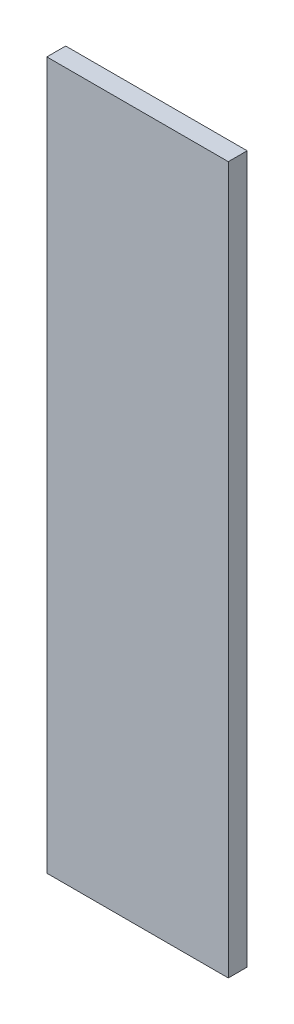
ISO-10303-21;
HEADER;
FILE_DESCRIPTION(('STEP AP214'),'2;1');
FILE_NAME('part.step','',(''),(''),'','','');
FILE_SCHEMA(('AUTOMOTIVE_DESIGN { 1 0 10303 214 1 1 1 1 }'));
ENDSEC;
DATA;
#1=APPLICATION_CONTEXT('core data for automotive mechanical design processes');
#2=APPLICATION_PROTOCOL_DEFINITION('international standard','automotive_design',2000,#1);
#3=PRODUCT_CONTEXT('',#1,'mechanical');
#4=PRODUCT('Part','Part','',(#3));
#5=PRODUCT_RELATED_PRODUCT_CATEGORY('part','',(#4));
#6=PRODUCT_DEFINITION_FORMATION('','',#4);
#7=PRODUCT_DEFINITION_CONTEXT('part definition',#1,'design');
#8=PRODUCT_DEFINITION('design','',#6,#7);
#9=PRODUCT_DEFINITION_SHAPE('','',#8);
#10=(LENGTH_UNIT() NAMED_UNIT(*) SI_UNIT(.MILLI.,.METRE.));
#11=(NAMED_UNIT(*) PLANE_ANGLE_UNIT() SI_UNIT($,.RADIAN.));
#12=(NAMED_UNIT(*) SI_UNIT($,.STERADIAN.) SOLID_ANGLE_UNIT());
#13=UNCERTAINTY_MEASURE_WITH_UNIT(LENGTH_MEASURE(1.E-05),#10,'distance_accuracy_value','');
#14=(GEOMETRIC_REPRESENTATION_CONTEXT(3) GLOBAL_UNCERTAINTY_ASSIGNED_CONTEXT((#13)) GLOBAL_UNIT_ASSIGNED_CONTEXT((#10,
#11,#12)) REPRESENTATION_CONTEXT('',''));
#15=CARTESIAN_POINT('',(0.,0.,0.));
#16=DIRECTION('',(0.,0.,1.));
#17=DIRECTION('',(1.,0.,0.));
#18=AXIS2_PLACEMENT_3D('',#15,#16,#17);
#19=CARTESIAN_POINT('',(-3.85,-15.,0.8));
#20=DIRECTION('',(1.,0.,0.));
#21=DIRECTION('',(0.,0.,-1.));
#22=AXIS2_PLACEMENT_3D('',#19,#20,#21);
#23=PLANE('',#22);
#24=DIRECTION('',(0.,-1.,0.));
#25=VECTOR('',#24,1.);
#26=CARTESIAN_POINT('',(-3.85,-15.,0.));
#27=LINE('',#26,#25);
#28=CARTESIAN_POINT('',(-3.85,15.,0.));
#29=VERTEX_POINT('',#28);
#30=CARTESIAN_POINT('',(-3.85,-15.,0.));
#31=VERTEX_POINT('',#30);
#32=EDGE_CURVE('E102',#29,#31,#27,.T.);
#33=ORIENTED_EDGE('',*,*,#32,.T.);
#34=DIRECTION('',(0.,0.,-1.));
#35=VECTOR('',#34,1.);
#36=CARTESIAN_POINT('',(-3.85,-15.,0.8));
#37=LINE('',#36,#35);
#38=CARTESIAN_POINT('',(-3.85,-15.,0.8));
#39=VERTEX_POINT('',#38);
#40=EDGE_CURVE('E11',#39,#31,#37,.T.);
#41=ORIENTED_EDGE('',*,*,#40,.F.);
#42=DIRECTION('',(0.,-1.,0.));
#43=VECTOR('',#42,1.);
#44=CARTESIAN_POINT('',(-3.85,-15.,0.8));
#45=LINE('',#44,#43);
#46=CARTESIAN_POINT('',(-3.85,15.,0.8));
#47=VERTEX_POINT('',#46);
#48=EDGE_CURVE('E90',#47,#39,#45,.T.);
#49=ORIENTED_EDGE('',*,*,#48,.F.);
#50=DIRECTION('',(0.,0.,-1.));
#51=VECTOR('',#50,1.);
#52=CARTESIAN_POINT('',(-3.85,15.,0.8));
#53=LINE('',#52,#51);
#54=EDGE_CURVE('E98',#47,#29,#53,.T.);
#55=ORIENTED_EDGE('',*,*,#54,.T.);
#56=EDGE_LOOP('',(#33,#41,#49,#55));
#57=FACE_BOUND('',#56,.T.);
#58=ADVANCED_FACE('F39',(#57),#23,.F.);
#59=CARTESIAN_POINT('',(3.85,-15.,0.8));
#60=DIRECTION('',(0.,1.,0.));
#61=DIRECTION('',(-1.,0.,0.));
#62=AXIS2_PLACEMENT_3D('',#59,#60,#61);
#63=PLANE('',#62);
#64=DIRECTION('',(1.,0.,0.));
#65=VECTOR('',#64,1.);
#66=CARTESIAN_POINT('',(3.85,-15.,0.));
#67=LINE('',#66,#65);
#68=CARTESIAN_POINT('',(3.85,-15.,0.));
#69=VERTEX_POINT('',#68);
#70=EDGE_CURVE('E94',#31,#69,#67,.T.);
#71=ORIENTED_EDGE('',*,*,#70,.T.);
#72=DIRECTION('',(0.,0.,-1.));
#73=VECTOR('',#72,1.);
#74=CARTESIAN_POINT('',(3.85,-15.,0.8));
#75=LINE('',#74,#73);
#76=CARTESIAN_POINT('',(3.85,-15.,0.8));
#77=VERTEX_POINT('',#76);
#78=EDGE_CURVE('E47',#77,#69,#75,.T.);
#79=ORIENTED_EDGE('',*,*,#78,.F.);
#80=DIRECTION('',(1.,0.,0.));
#81=VECTOR('',#80,1.);
#82=CARTESIAN_POINT('',(3.85,-15.,0.8));
#83=LINE('',#82,#81);
#84=EDGE_CURVE('E85',#39,#77,#83,.T.);
#85=ORIENTED_EDGE('',*,*,#84,.F.);
#86=ORIENTED_EDGE('',*,*,#40,.T.);
#87=EDGE_LOOP('',(#71,#79,#85,#86));
#88=FACE_BOUND('',#87,.T.);
#89=ADVANCED_FACE('F93',(#88),#63,.F.);
#90=CARTESIAN_POINT('',(3.85,-15.,0.8));
#91=DIRECTION('',(-1.,0.,0.));
#92=DIRECTION('',(0.,0.,1.));
#93=AXIS2_PLACEMENT_3D('',#90,#91,#92);
#94=PLANE('',#93);
#95=DIRECTION('',(0.,1.,0.));
#96=VECTOR('',#95,1.);
#97=CARTESIAN_POINT('',(3.85,-15.,0.));
#98=LINE('',#97,#96);
#99=CARTESIAN_POINT('',(3.85,15.,0.));
#100=VERTEX_POINT('',#99);
#101=EDGE_CURVE('E72',#69,#100,#98,.T.);
#102=ORIENTED_EDGE('',*,*,#101,.T.);
#103=DIRECTION('',(0.,0.,-1.));
#104=VECTOR('',#103,1.);
#105=CARTESIAN_POINT('',(3.85,15.,0.8));
#106=LINE('',#105,#104);
#107=CARTESIAN_POINT('',(3.85,15.,0.8));
#108=VERTEX_POINT('',#107);
#109=EDGE_CURVE('E95',#108,#100,#106,.T.);
#110=ORIENTED_EDGE('',*,*,#109,.F.);
#111=DIRECTION('',(0.,1.,0.));
#112=VECTOR('',#111,1.);
#113=CARTESIAN_POINT('',(3.85,-15.,0.8));
#114=LINE('',#113,#112);
#115=EDGE_CURVE('E88',#77,#108,#114,.T.);
#116=ORIENTED_EDGE('',*,*,#115,.F.);
#117=ORIENTED_EDGE('',*,*,#78,.T.);
#118=EDGE_LOOP('',(#102,#110,#116,#117));
#119=FACE_BOUND('',#118,.T.);
#120=ADVANCED_FACE('F96',(#119),#94,.F.);
#121=CARTESIAN_POINT('',(3.85,15.,0.8));
#122=DIRECTION('',(0.,-1.,0.));
#123=DIRECTION('',(1.,0.,0.));
#124=AXIS2_PLACEMENT_3D('',#121,#122,#123);
#125=PLANE('',#124);
#126=DIRECTION('',(-1.,0.,0.));
#127=VECTOR('',#126,1.);
#128=CARTESIAN_POINT('',(3.85,15.,0.));
#129=LINE('',#128,#127);
#130=EDGE_CURVE('E78',#100,#29,#129,.T.);
#131=ORIENTED_EDGE('',*,*,#130,.T.);
#132=ORIENTED_EDGE('',*,*,#54,.F.);
#133=DIRECTION('',(-1.,0.,0.));
#134=VECTOR('',#133,1.);
#135=CARTESIAN_POINT('',(3.85,15.,0.8));
#136=LINE('',#135,#134);
#137=EDGE_CURVE('E55',#108,#47,#136,.T.);
#138=ORIENTED_EDGE('',*,*,#137,.F.);
#139=ORIENTED_EDGE('',*,*,#109,.T.);
#140=EDGE_LOOP('',(#131,#132,#138,#139));
#141=FACE_BOUND('',#140,.T.);
#142=ADVANCED_FACE('F109',(#141),#125,.F.);
#143=CARTESIAN_POINT('',(0.,0.,0.8));
#144=DIRECTION('',(0.,0.,1.));
#145=DIRECTION('',(1.,0.,0.));
#146=AXIS2_PLACEMENT_3D('',#143,#144,#145);
#147=PLANE('',#146);
#148=ORIENTED_EDGE('',*,*,#48,.T.);
#149=ORIENTED_EDGE('',*,*,#84,.T.);
#150=ORIENTED_EDGE('',*,*,#115,.T.);
#151=ORIENTED_EDGE('',*,*,#137,.T.);
#152=EDGE_LOOP('',(#148,#149,#150,#151));
#153=FACE_BOUND('',#152,.T.);
#154=ADVANCED_FACE('F86',(#153),#147,.T.);
#155=CARTESIAN_POINT('',(0.,0.,0.));
#156=DIRECTION('',(0.,0.,1.));
#157=DIRECTION('',(1.,0.,0.));
#158=AXIS2_PLACEMENT_3D('',#155,#156,#157);
#159=PLANE('',#158);
#160=ORIENTED_EDGE('',*,*,#32,.F.);
#161=ORIENTED_EDGE('',*,*,#130,.F.);
#162=ORIENTED_EDGE('',*,*,#101,.F.);
#163=ORIENTED_EDGE('',*,*,#70,.F.);
#164=EDGE_LOOP('',(#160,#161,#162,#163));
#165=FACE_BOUND('',#164,.T.);
#166=ADVANCED_FACE('F112',(#165),#159,.F.);
#167=CLOSED_SHELL('',(#58,#89,#120,#142,#154,#166));
#168=MANIFOLD_SOLID_BREP('B2',#167);
#169=ADVANCED_BREP_SHAPE_REPRESENTATION('',(#18,#168),#14);
#170=SHAPE_DEFINITION_REPRESENTATION(#9,#169);
ENDSEC;
END-ISO-10303-21;
